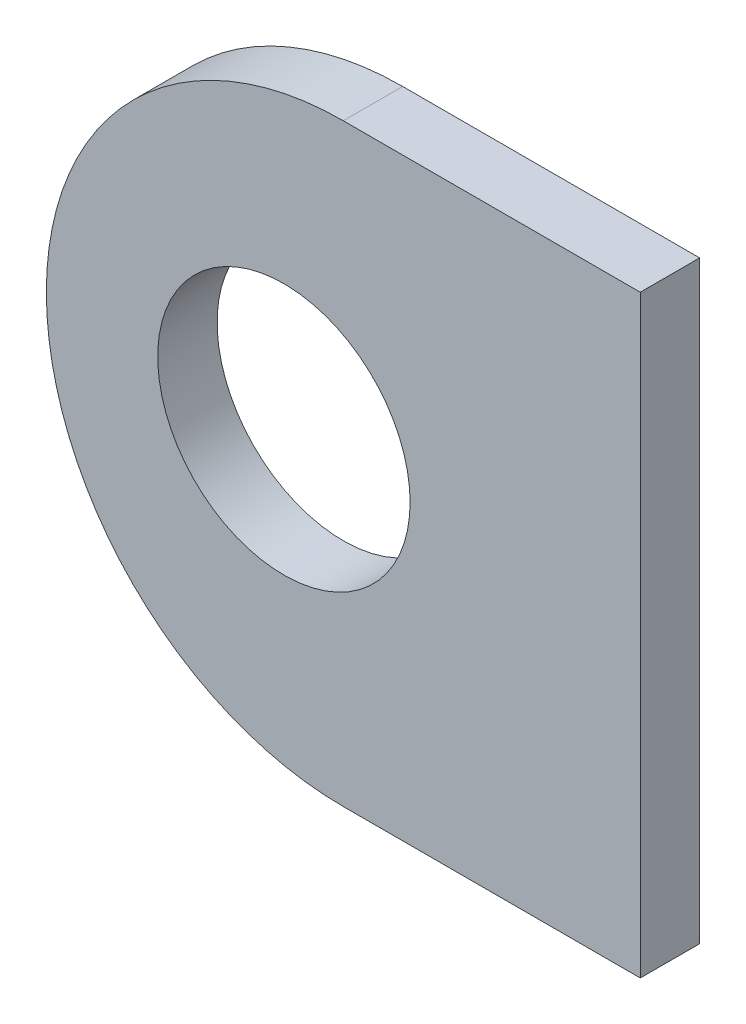
ISO-10303-21;
HEADER;
FILE_DESCRIPTION(('STEP AP214'),'2;1');
FILE_NAME('part.step','',(''),(''),'','','');
FILE_SCHEMA(('AUTOMOTIVE_DESIGN { 1 0 10303 214 1 1 1 1 }'));
ENDSEC;
DATA;
#1=APPLICATION_CONTEXT('core data for automotive mechanical design processes');
#2=APPLICATION_PROTOCOL_DEFINITION('international standard','automotive_design',2000,#1);
#3=PRODUCT_CONTEXT('',#1,'mechanical');
#4=PRODUCT('Part','Part','',(#3));
#5=PRODUCT_RELATED_PRODUCT_CATEGORY('part','',(#4));
#6=PRODUCT_DEFINITION_FORMATION('','',#4);
#7=PRODUCT_DEFINITION_CONTEXT('part definition',#1,'design');
#8=PRODUCT_DEFINITION('design','',#6,#7);
#9=PRODUCT_DEFINITION_SHAPE('','',#8);
#10=(LENGTH_UNIT() NAMED_UNIT(*) SI_UNIT(.MILLI.,.METRE.));
#11=(NAMED_UNIT(*) PLANE_ANGLE_UNIT() SI_UNIT($,.RADIAN.));
#12=(NAMED_UNIT(*) SI_UNIT($,.STERADIAN.) SOLID_ANGLE_UNIT());
#13=UNCERTAINTY_MEASURE_WITH_UNIT(LENGTH_MEASURE(1.E-05),#10,'distance_accuracy_value','');
#14=(GEOMETRIC_REPRESENTATION_CONTEXT(3) GLOBAL_UNCERTAINTY_ASSIGNED_CONTEXT((#13)) GLOBAL_UNIT_ASSIGNED_CONTEXT((#10,
#11,#12)) REPRESENTATION_CONTEXT('',''));
#15=CARTESIAN_POINT('',(0.,0.,0.));
#16=DIRECTION('',(0.,0.,1.));
#17=DIRECTION('',(1.,0.,0.));
#18=AXIS2_PLACEMENT_3D('',#15,#16,#17);
#19=CARTESIAN_POINT('',(10.,9.99999999999999,2.));
#20=DIRECTION('',(-1.,0.,0.));
#21=DIRECTION('',(0.,-1.,0.));
#22=AXIS2_PLACEMENT_3D('',#19,#20,#21);
#23=PLANE('',#22);
#24=DIRECTION('',(0.,1.,0.));
#25=VECTOR('',#24,1.);
#26=CARTESIAN_POINT('',(10.,9.99999999999999,0.));
#27=LINE('',#26,#25);
#28=CARTESIAN_POINT('',(10.,-10.,0.));
#29=VERTEX_POINT('',#28);
#30=CARTESIAN_POINT('',(10.,9.99999999999999,0.));
#31=VERTEX_POINT('',#30);
#32=EDGE_CURVE('E111',#29,#31,#27,.T.);
#33=ORIENTED_EDGE('',*,*,#32,.T.);
#34=DIRECTION('',(0.,0.,-1.));
#35=VECTOR('',#34,1.);
#36=CARTESIAN_POINT('',(10.,9.99999999999999,2.));
#37=LINE('',#36,#35);
#38=CARTESIAN_POINT('',(10.,9.99999999999999,2.));
#39=VERTEX_POINT('',#38);
#40=EDGE_CURVE('E95',#39,#31,#37,.T.);
#41=ORIENTED_EDGE('',*,*,#40,.F.);
#42=DIRECTION('',(0.,1.,0.));
#43=VECTOR('',#42,1.);
#44=CARTESIAN_POINT('',(10.,9.99999999999999,2.));
#45=LINE('',#44,#43);
#46=CARTESIAN_POINT('',(10.,-10.,2.));
#47=VERTEX_POINT('',#46);
#48=EDGE_CURVE('E99',#47,#39,#45,.T.);
#49=ORIENTED_EDGE('',*,*,#48,.F.);
#50=DIRECTION('',(0.,0.,-1.));
#51=VECTOR('',#50,1.);
#52=CARTESIAN_POINT('',(10.,-10.,2.));
#53=LINE('',#52,#51);
#54=EDGE_CURVE('E114',#47,#29,#53,.T.);
#55=ORIENTED_EDGE('',*,*,#54,.T.);
#56=EDGE_LOOP('',(#33,#41,#49,#55));
#57=FACE_BOUND('',#56,.T.);
#58=ADVANCED_FACE('F45',(#57),#23,.F.);
#59=CARTESIAN_POINT('',(-10.,9.99999999999999,2.));
#60=DIRECTION('',(0.,-1.,0.));
#61=DIRECTION('',(0.,0.,-1.));
#62=AXIS2_PLACEMENT_3D('',#59,#60,#61);
#63=PLANE('',#62);
#64=DIRECTION('',(-1.,0.,0.));
#65=VECTOR('',#64,1.);
#66=CARTESIAN_POINT('',(-10.,9.99999999999999,0.));
#67=LINE('',#66,#65);
#68=CARTESIAN_POINT('',(0.,9.99999999999999,0.));
#69=VERTEX_POINT('',#68);
#70=EDGE_CURVE('E160',#31,#69,#67,.T.);
#71=ORIENTED_EDGE('',*,*,#70,.T.);
#72=DIRECTION('',(0.,0.,-1.));
#73=VECTOR('',#72,1.);
#74=CARTESIAN_POINT('',(0.,9.99999999999999,2.));
#75=LINE('',#74,#73);
#76=CARTESIAN_POINT('',(0.,9.99999999999999,2.));
#77=VERTEX_POINT('',#76);
#78=EDGE_CURVE('E11',#69,#77,#75,.F.);
#79=ORIENTED_EDGE('',*,*,#78,.T.);
#80=DIRECTION('',(-1.,0.,0.));
#81=VECTOR('',#80,1.);
#82=CARTESIAN_POINT('',(-10.,9.99999999999999,2.));
#83=LINE('',#82,#81);
#84=EDGE_CURVE('E91',#39,#77,#83,.T.);
#85=ORIENTED_EDGE('',*,*,#84,.F.);
#86=ORIENTED_EDGE('',*,*,#40,.T.);
#87=EDGE_LOOP('',(#71,#79,#85,#86));
#88=FACE_BOUND('',#87,.T.);
#89=ADVANCED_FACE('F93',(#88),#63,.F.);
#90=CARTESIAN_POINT('',(-9.99999999999999,-10.,2.));
#91=DIRECTION('',(0.,1.,0.));
#92=DIRECTION('',(0.,0.,1.));
#93=AXIS2_PLACEMENT_3D('',#90,#91,#92);
#94=PLANE('',#93);
#95=DIRECTION('',(1.,0.,0.));
#96=VECTOR('',#95,1.);
#97=CARTESIAN_POINT('',(-9.99999999999999,-10.,2.));
#98=LINE('',#97,#96);
#99=CARTESIAN_POINT('',(0.,-10.,2.));
#100=VERTEX_POINT('',#99);
#101=EDGE_CURVE('E98',#100,#47,#98,.T.);
#102=ORIENTED_EDGE('',*,*,#101,.F.);
#103=DIRECTION('',(0.,0.,-1.));
#104=VECTOR('',#103,1.);
#105=CARTESIAN_POINT('',(0.,-10.,2.));
#106=LINE('',#105,#104);
#107=CARTESIAN_POINT('',(0.,-10.,0.));
#108=VERTEX_POINT('',#107);
#109=EDGE_CURVE('E113',#100,#108,#106,.T.);
#110=ORIENTED_EDGE('',*,*,#109,.T.);
#111=DIRECTION('',(1.,0.,0.));
#112=VECTOR('',#111,1.);
#113=CARTESIAN_POINT('',(-9.99999999999999,-10.,0.));
#114=LINE('',#113,#112);
#115=EDGE_CURVE('E108',#108,#29,#114,.T.);
#116=ORIENTED_EDGE('',*,*,#115,.T.);
#117=ORIENTED_EDGE('',*,*,#54,.F.);
#118=EDGE_LOOP('',(#102,#110,#116,#117));
#119=FACE_BOUND('',#118,.T.);
#120=ADVANCED_FACE('F137',(#119),#94,.F.);
#121=CARTESIAN_POINT('',(0.,0.,2.));
#122=DIRECTION('',(0.,0.,1.));
#123=DIRECTION('',(1.,0.,0.));
#124=AXIS2_PLACEMENT_3D('',#121,#122,#123);
#125=PLANE('',#124);
#126=CARTESIAN_POINT('',(-2.,0.,2.));
#127=DIRECTION('',(0.,0.,1.));
#128=DIRECTION('',(1.,0.,0.));
#129=AXIS2_PLACEMENT_3D('',#126,#127,#128);
#130=CIRCLE('',#129,4.25);
#131=CARTESIAN_POINT('',(2.25,0.,2.));
#132=VERTEX_POINT('',#131);
#133=EDGE_CURVE('E147',#132,#132,#130,.T.);
#134=ORIENTED_EDGE('',*,*,#133,.F.);
#135=EDGE_LOOP('',(#134));
#136=FACE_BOUND('',#135,.T.);
#137=CARTESIAN_POINT('',(0.,0.,2.));
#138=DIRECTION('',(0.,0.,1.));
#139=DIRECTION('',(1.,0.,0.));
#140=AXIS2_PLACEMENT_3D('',#137,#138,#139);
#141=CIRCLE('',#140,10.);
#142=CARTESIAN_POINT('',(-10.,0.,2.));
#143=VERTEX_POINT('',#142);
#144=EDGE_CURVE('E62',#77,#143,#141,.T.);
#145=ORIENTED_EDGE('',*,*,#144,.T.);
#146=CARTESIAN_POINT('',(0.,0.,2.));
#147=DIRECTION('',(0.,0.,1.));
#148=DIRECTION('',(1.,0.,0.));
#149=AXIS2_PLACEMENT_3D('',#146,#147,#148);
#150=CIRCLE('',#149,10.);
#151=EDGE_CURVE('E55',#143,#100,#150,.T.);
#152=ORIENTED_EDGE('',*,*,#151,.T.);
#153=ORIENTED_EDGE('',*,*,#101,.T.);
#154=ORIENTED_EDGE('',*,*,#48,.T.);
#155=ORIENTED_EDGE('',*,*,#84,.T.);
#156=EDGE_LOOP('',(#145,#152,#153,#154,#155));
#157=FACE_BOUND('',#156,.T.);
#158=ADVANCED_FACE('F102',(#136,#157),#125,.T.);
#159=CARTESIAN_POINT('',(0.,0.,0.));
#160=DIRECTION('',(0.,0.,1.));
#161=DIRECTION('',(1.,0.,0.));
#162=AXIS2_PLACEMENT_3D('',#159,#160,#161);
#163=PLANE('',#162);
#164=CARTESIAN_POINT('',(-2.,0.,0.));
#165=DIRECTION('',(0.,0.,1.));
#166=DIRECTION('',(1.,0.,0.));
#167=AXIS2_PLACEMENT_3D('',#164,#165,#166);
#168=CIRCLE('',#167,4.25);
#169=CARTESIAN_POINT('',(2.25,0.,0.));
#170=VERTEX_POINT('',#169);
#171=EDGE_CURVE('E150',#170,#170,#168,.T.);
#172=ORIENTED_EDGE('',*,*,#171,.T.);
#173=EDGE_LOOP('',(#172));
#174=FACE_BOUND('',#173,.T.);
#175=ORIENTED_EDGE('',*,*,#115,.F.);
#176=CARTESIAN_POINT('',(0.,0.,0.));
#177=DIRECTION('',(0.,0.,1.));
#178=DIRECTION('',(1.,0.,0.));
#179=AXIS2_PLACEMENT_3D('',#176,#177,#178);
#180=CIRCLE('',#179,10.);
#181=CARTESIAN_POINT('',(-10.,0.,0.));
#182=VERTEX_POINT('',#181);
#183=EDGE_CURVE('E126',#108,#182,#180,.F.);
#184=ORIENTED_EDGE('',*,*,#183,.T.);
#185=CARTESIAN_POINT('',(0.,0.,0.));
#186=DIRECTION('',(0.,0.,1.));
#187=DIRECTION('',(1.,0.,0.));
#188=AXIS2_PLACEMENT_3D('',#185,#186,#187);
#189=CIRCLE('',#188,10.);
#190=EDGE_CURVE('E119',#182,#69,#189,.F.);
#191=ORIENTED_EDGE('',*,*,#190,.T.);
#192=ORIENTED_EDGE('',*,*,#70,.F.);
#193=ORIENTED_EDGE('',*,*,#32,.F.);
#194=EDGE_LOOP('',(#175,#184,#191,#192,#193));
#195=FACE_BOUND('',#194,.T.);
#196=ADVANCED_FACE('F144',(#174,#195),#163,.F.);
#197=CARTESIAN_POINT('',(-2.,0.,0.));
#198=DIRECTION('',(0.,0.,1.));
#199=DIRECTION('',(1.,0.,0.));
#200=AXIS2_PLACEMENT_3D('',#197,#198,#199);
#201=CYLINDRICAL_SURFACE('',#200,4.25);
#202=ORIENTED_EDGE('',*,*,#171,.F.);
#203=EDGE_LOOP('',(#202));
#204=FACE_BOUND('',#203,.T.);
#205=ORIENTED_EDGE('',*,*,#133,.T.);
#206=EDGE_LOOP('',(#205));
#207=FACE_BOUND('',#206,.T.);
#208=ADVANCED_FACE('F166',(#204,#207),#201,.F.);
#209=CARTESIAN_POINT('',(0.,0.,2.));
#210=DIRECTION('',(0.,0.,-1.));
#211=DIRECTION('',(-1.,0.,0.));
#212=AXIS2_PLACEMENT_3D('',#209,#210,#211);
#213=CYLINDRICAL_SURFACE('',#212,10.);
#214=DIRECTION('',(0.,0.,-1.));
#215=VECTOR('',#214,1.);
#216=CARTESIAN_POINT('',(-10.,0.,2.));
#217=LINE('',#216,#215);
#218=EDGE_CURVE('E49',#143,#182,#217,.T.);
#219=ORIENTED_EDGE('',*,*,#218,.F.);
#220=ORIENTED_EDGE('',*,*,#144,.F.);
#221=ORIENTED_EDGE('',*,*,#78,.F.);
#222=ORIENTED_EDGE('',*,*,#190,.F.);
#223=EDGE_LOOP('',(#219,#220,#221,#222));
#224=FACE_BOUND('',#223,.T.);
#225=ADVANCED_FACE('F47',(#224),#213,.T.);
#226=CARTESIAN_POINT('',(0.,0.,2.));
#227=DIRECTION('',(0.,0.,-1.));
#228=DIRECTION('',(-1.,0.,0.));
#229=AXIS2_PLACEMENT_3D('',#226,#227,#228);
#230=CYLINDRICAL_SURFACE('',#229,10.);
#231=ORIENTED_EDGE('',*,*,#151,.F.);
#232=ORIENTED_EDGE('',*,*,#218,.T.);
#233=ORIENTED_EDGE('',*,*,#183,.F.);
#234=ORIENTED_EDGE('',*,*,#109,.F.);
#235=EDGE_LOOP('',(#231,#232,#233,#234));
#236=FACE_BOUND('',#235,.T.);
#237=ADVANCED_FACE('F141',(#236),#230,.T.);
#238=CLOSED_SHELL('',(#58,#89,#120,#158,#196,#208,#225,#237));
#239=MANIFOLD_SOLID_BREP('B2',#238);
#240=ADVANCED_BREP_SHAPE_REPRESENTATION('',(#18,#239),#14);
#241=SHAPE_DEFINITION_REPRESENTATION(#9,#240);
ENDSEC;
END-ISO-10303-21;
